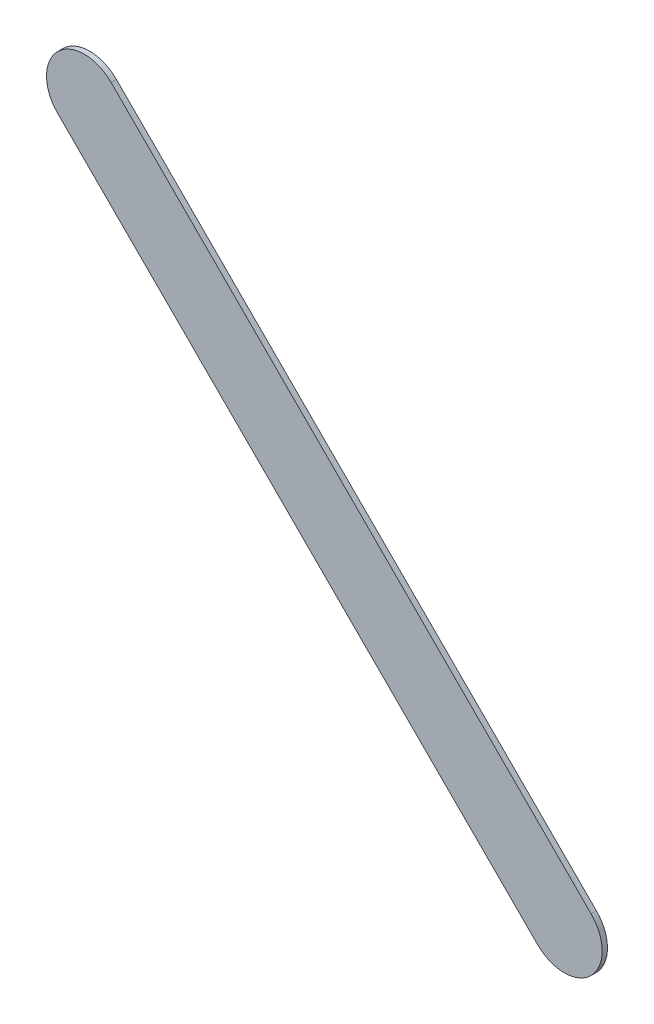
ISO-10303-21;
HEADER;
FILE_DESCRIPTION(('STEP AP214'),'2;1');
FILE_NAME('part.step','',(''),(''),'','','');
FILE_SCHEMA(('AUTOMOTIVE_DESIGN { 1 0 10303 214 1 1 1 1 }'));
ENDSEC;
DATA;
#1=APPLICATION_CONTEXT('core data for automotive mechanical design processes');
#2=APPLICATION_PROTOCOL_DEFINITION('international standard','automotive_design',2000,#1);
#3=PRODUCT_CONTEXT('',#1,'mechanical');
#4=PRODUCT('Part','Part','',(#3));
#5=PRODUCT_RELATED_PRODUCT_CATEGORY('part','',(#4));
#6=PRODUCT_DEFINITION_FORMATION('','',#4);
#7=PRODUCT_DEFINITION_CONTEXT('part definition',#1,'design');
#8=PRODUCT_DEFINITION('design','',#6,#7);
#9=PRODUCT_DEFINITION_SHAPE('','',#8);
#10=(LENGTH_UNIT() NAMED_UNIT(*) SI_UNIT(.MILLI.,.METRE.));
#11=(NAMED_UNIT(*) PLANE_ANGLE_UNIT() SI_UNIT($,.RADIAN.));
#12=(NAMED_UNIT(*) SI_UNIT($,.STERADIAN.) SOLID_ANGLE_UNIT());
#13=UNCERTAINTY_MEASURE_WITH_UNIT(LENGTH_MEASURE(1.E-05),#10,'distance_accuracy_value','');
#14=(GEOMETRIC_REPRESENTATION_CONTEXT(3) GLOBAL_UNCERTAINTY_ASSIGNED_CONTEXT((#13)) GLOBAL_UNIT_ASSIGNED_CONTEXT((#10,
#11,#12)) REPRESENTATION_CONTEXT('',''));
#15=CARTESIAN_POINT('',(0.,0.,0.));
#16=DIRECTION('',(0.,0.,1.));
#17=DIRECTION('',(1.,0.,0.));
#18=AXIS2_PLACEMENT_3D('',#15,#16,#17);
#19=CARTESIAN_POINT('',(166.673776,-126.823223,0.));
#20=DIRECTION('',(0.,0.,1.));
#21=DIRECTION('',(1.,0.,0.));
#22=AXIS2_PLACEMENT_3D('',#19,#20,#21);
#23=PLANE('',#22);
#24=DIRECTION('',(-0.707106781186548,0.707106781186548,0.));
#25=VECTOR('',#24,1.);
#26=CARTESIAN_POINT('',(166.673776,-126.823223,0.));
#27=LINE('',#26,#25);
#28=CARTESIAN_POINT('',(166.673776,-126.823223,0.));
#29=VERTEX_POINT('',#28);
#30=CARTESIAN_POINT('',(163.498776,-123.648223,0.));
#31=VERTEX_POINT('',#30);
#32=EDGE_CURVE('E97',#29,#31,#27,.T.);
#33=ORIENTED_EDGE('',*,*,#32,.T.);
#34=CARTESIAN_POINT('',(163.3219995,-123.8249995,0.));
#35=DIRECTION('',(0.,0.,1.));
#36=DIRECTION('',(0.707106781186548,0.707106781186548,0.));
#37=AXIS2_PLACEMENT_3D('',#34,#35,#36);
#38=CIRCLE('',#37,0.249999723809);
#39=CARTESIAN_POINT('',(163.145223,-124.001776,0.));
#40=VERTEX_POINT('',#39);
#41=EDGE_CURVE('E92',#31,#40,#38,.T.);
#42=ORIENTED_EDGE('',*,*,#41,.T.);
#43=DIRECTION('',(0.707106781186548,-0.707106781186548,0.));
#44=VECTOR('',#43,1.);
#45=CARTESIAN_POINT('',(163.145223,-124.001776,0.));
#46=LINE('',#45,#44);
#47=CARTESIAN_POINT('',(166.320223,-127.176776,0.));
#48=VERTEX_POINT('',#47);
#49=EDGE_CURVE('E69',#40,#48,#46,.T.);
#50=ORIENTED_EDGE('',*,*,#49,.T.);
#51=CARTESIAN_POINT('',(166.4969995,-126.9999995,0.));
#52=DIRECTION('',(0.,0.,1.));
#53=DIRECTION('',(-0.707106781186548,-0.707106781186548,0.));
#54=AXIS2_PLACEMENT_3D('',#51,#52,#53);
#55=CIRCLE('',#54,0.249999723809);
#56=EDGE_CURVE('E11',#48,#29,#55,.T.);
#57=ORIENTED_EDGE('',*,*,#56,.T.);
#58=EDGE_LOOP('',(#33,#42,#50,#57));
#59=FACE_BOUND('',#58,.T.);
#60=ADVANCED_FACE('F17',(#59),#23,.T.);
#61=CARTESIAN_POINT('',(166.673776,-126.823223,-0.035));
#62=DIRECTION('',(0.,0.,1.));
#63=DIRECTION('',(1.,0.,0.));
#64=AXIS2_PLACEMENT_3D('',#61,#62,#63);
#65=PLANE('',#64);
#66=CARTESIAN_POINT('',(166.4969995,-126.9999995,-0.035));
#67=DIRECTION('',(0.,0.,1.));
#68=DIRECTION('',(-0.707106781186548,-0.707106781186548,0.));
#69=AXIS2_PLACEMENT_3D('',#66,#67,#68);
#70=CIRCLE('',#69,0.249999723809);
#71=CARTESIAN_POINT('',(166.320223,-127.176776,-0.035));
#72=VERTEX_POINT('',#71);
#73=CARTESIAN_POINT('',(166.673776,-126.823223,-0.035));
#74=VERTEX_POINT('',#73);
#75=EDGE_CURVE('E27',#72,#74,#70,.T.);
#76=ORIENTED_EDGE('',*,*,#75,.F.);
#77=DIRECTION('',(0.707106781186548,-0.707106781186548,0.));
#78=VECTOR('',#77,1.);
#79=CARTESIAN_POINT('',(163.145223,-124.001776,-0.035));
#80=LINE('',#79,#78);
#81=CARTESIAN_POINT('',(163.145223,-124.001776,-0.035));
#82=VERTEX_POINT('',#81);
#83=EDGE_CURVE('E59',#82,#72,#80,.T.);
#84=ORIENTED_EDGE('',*,*,#83,.F.);
#85=CARTESIAN_POINT('',(163.3219995,-123.8249995,-0.035));
#86=DIRECTION('',(0.,0.,1.));
#87=DIRECTION('',(0.707106781186548,0.707106781186548,0.));
#88=AXIS2_PLACEMENT_3D('',#85,#86,#87);
#89=CIRCLE('',#88,0.249999723809);
#90=CARTESIAN_POINT('',(163.498776,-123.648223,-0.035));
#91=VERTEX_POINT('',#90);
#92=EDGE_CURVE('E78',#91,#82,#89,.T.);
#93=ORIENTED_EDGE('',*,*,#92,.F.);
#94=DIRECTION('',(-0.707106781186548,0.707106781186548,0.));
#95=VECTOR('',#94,1.);
#96=CARTESIAN_POINT('',(166.673776,-126.823223,-0.035));
#97=LINE('',#96,#95);
#98=EDGE_CURVE('E82',#74,#91,#97,.T.);
#99=ORIENTED_EDGE('',*,*,#98,.F.);
#100=EDGE_LOOP('',(#76,#84,#93,#99));
#101=FACE_BOUND('',#100,.T.);
#102=ADVANCED_FACE('F80',(#101),#65,.F.);
#103=CARTESIAN_POINT('',(166.4969995,-126.9999995,-0.035));
#104=DIRECTION('',(0.,0.,-1.));
#105=DIRECTION('',(-0.707106781186548,-0.707106781186548,0.));
#106=AXIS2_PLACEMENT_3D('',#103,#104,#105);
#107=CYLINDRICAL_SURFACE('',#106,0.249999723809);
#108=ORIENTED_EDGE('',*,*,#75,.T.);
#109=DIRECTION('',(0.,0.,1.));
#110=VECTOR('',#109,1.);
#111=CARTESIAN_POINT('',(166.673776,-126.823223,-0.035));
#112=LINE('',#111,#110);
#113=EDGE_CURVE('E87',#74,#29,#112,.T.);
#114=ORIENTED_EDGE('',*,*,#113,.T.);
#115=ORIENTED_EDGE('',*,*,#56,.F.);
#116=DIRECTION('',(0.,0.,1.));
#117=VECTOR('',#116,1.);
#118=CARTESIAN_POINT('',(166.320223,-127.176776,-0.035));
#119=LINE('',#118,#117);
#120=EDGE_CURVE('E20',#72,#48,#119,.T.);
#121=ORIENTED_EDGE('',*,*,#120,.F.);
#122=EDGE_LOOP('',(#108,#114,#115,#121));
#123=FACE_BOUND('',#122,.T.);
#124=ADVANCED_FACE('F124',(#123),#107,.T.);
#125=CARTESIAN_POINT('',(163.145223,-124.001776,-0.035));
#126=DIRECTION('',(0.707106781186548,0.707106781186548,0.));
#127=DIRECTION('',(0.,0.,-1.));
#128=AXIS2_PLACEMENT_3D('',#125,#126,#127);
#129=PLANE('',#128);
#130=ORIENTED_EDGE('',*,*,#83,.T.);
#131=ORIENTED_EDGE('',*,*,#120,.T.);
#132=ORIENTED_EDGE('',*,*,#49,.F.);
#133=DIRECTION('',(0.,0.,1.));
#134=VECTOR('',#133,1.);
#135=CARTESIAN_POINT('',(163.145223,-124.001776,-0.035));
#136=LINE('',#135,#134);
#137=EDGE_CURVE('E86',#82,#40,#136,.T.);
#138=ORIENTED_EDGE('',*,*,#137,.F.);
#139=EDGE_LOOP('',(#130,#131,#132,#138));
#140=FACE_BOUND('',#139,.T.);
#141=ADVANCED_FACE('F123',(#140),#129,.F.);
#142=CARTESIAN_POINT('',(163.3219995,-123.8249995,-0.035));
#143=DIRECTION('',(0.,0.,-1.));
#144=DIRECTION('',(0.707106781186548,0.707106781186548,0.));
#145=AXIS2_PLACEMENT_3D('',#142,#143,#144);
#146=CYLINDRICAL_SURFACE('',#145,0.249999723809);
#147=ORIENTED_EDGE('',*,*,#92,.T.);
#148=ORIENTED_EDGE('',*,*,#137,.T.);
#149=ORIENTED_EDGE('',*,*,#41,.F.);
#150=DIRECTION('',(0.,0.,1.));
#151=VECTOR('',#150,1.);
#152=CARTESIAN_POINT('',(163.498776,-123.648223,-0.035));
#153=LINE('',#152,#151);
#154=EDGE_CURVE('E90',#91,#31,#153,.T.);
#155=ORIENTED_EDGE('',*,*,#154,.F.);
#156=EDGE_LOOP('',(#147,#148,#149,#155));
#157=FACE_BOUND('',#156,.T.);
#158=ADVANCED_FACE('F91',(#157),#146,.T.);
#159=CARTESIAN_POINT('',(166.673776,-126.823223,-0.035));
#160=DIRECTION('',(-0.707106781186548,-0.707106781186548,0.));
#161=DIRECTION('',(-0.707106781186548,0.707106781186548,0.));
#162=AXIS2_PLACEMENT_3D('',#159,#160,#161);
#163=PLANE('',#162);
#164=ORIENTED_EDGE('',*,*,#98,.T.);
#165=ORIENTED_EDGE('',*,*,#154,.T.);
#166=ORIENTED_EDGE('',*,*,#32,.F.);
#167=ORIENTED_EDGE('',*,*,#113,.F.);
#168=EDGE_LOOP('',(#164,#165,#166,#167));
#169=FACE_BOUND('',#168,.T.);
#170=ADVANCED_FACE('F99',(#169),#163,.F.);
#171=CLOSED_SHELL('',(#60,#102,#124,#141,#158,#170));
#172=MANIFOLD_SOLID_BREP('B1',#171);
#173=ADVANCED_BREP_SHAPE_REPRESENTATION('',(#18,#172),#14);
#174=SHAPE_DEFINITION_REPRESENTATION(#9,#173);
ENDSEC;
END-ISO-10303-21;
